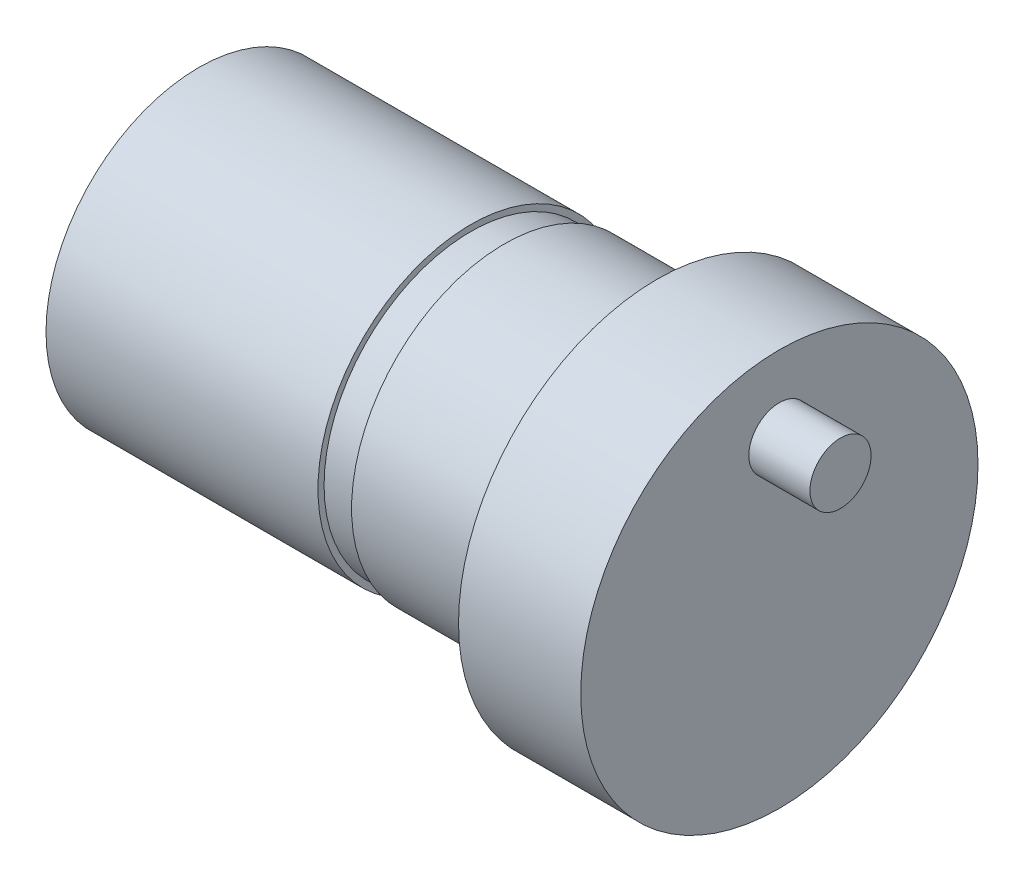
ISO-10303-21;
HEADER;
FILE_DESCRIPTION(('STEP AP214'),'2;1');
FILE_NAME('part.step','',(''),(''),'','','');
FILE_SCHEMA(('AUTOMOTIVE_DESIGN { 1 0 10303 214 1 1 1 1 }'));
ENDSEC;
DATA;
#1=APPLICATION_CONTEXT('core data for automotive mechanical design processes');
#2=APPLICATION_PROTOCOL_DEFINITION('international standard','automotive_design',2000,#1);
#3=PRODUCT_CONTEXT('',#1,'mechanical');
#4=PRODUCT('Part','Part','',(#3));
#5=PRODUCT_RELATED_PRODUCT_CATEGORY('part','',(#4));
#6=PRODUCT_DEFINITION_FORMATION('','',#4);
#7=PRODUCT_DEFINITION_CONTEXT('part definition',#1,'design');
#8=PRODUCT_DEFINITION('design','',#6,#7);
#9=PRODUCT_DEFINITION_SHAPE('','',#8);
#10=(LENGTH_UNIT() NAMED_UNIT(*) SI_UNIT(.MILLI.,.METRE.));
#11=(NAMED_UNIT(*) PLANE_ANGLE_UNIT() SI_UNIT($,.RADIAN.));
#12=(NAMED_UNIT(*) SI_UNIT($,.STERADIAN.) SOLID_ANGLE_UNIT());
#13=UNCERTAINTY_MEASURE_WITH_UNIT(LENGTH_MEASURE(1.E-05),#10,'distance_accuracy_value','');
#14=(GEOMETRIC_REPRESENTATION_CONTEXT(3) GLOBAL_UNCERTAINTY_ASSIGNED_CONTEXT((#13)) GLOBAL_UNIT_ASSIGNED_CONTEXT((#10,
#11,#12)) REPRESENTATION_CONTEXT('',''));
#15=CARTESIAN_POINT('',(0.,0.,0.));
#16=DIRECTION('',(0.,0.,1.));
#17=DIRECTION('',(1.,0.,0.));
#18=AXIS2_PLACEMENT_3D('',#15,#16,#17);
#19=CARTESIAN_POINT('',(-15.,0.,0.));
#20=DIRECTION('',(1.,0.,0.));
#21=DIRECTION('',(0.,0.,-1.));
#22=AXIS2_PLACEMENT_3D('',#19,#20,#21);
#23=CYLINDRICAL_SURFACE('',#22,5.);
#24=CARTESIAN_POINT('',(0.,0.,0.));
#25=DIRECTION('',(-1.,0.,0.));
#26=DIRECTION('',(0.,0.,1.));
#27=AXIS2_PLACEMENT_3D('',#24,#25,#26);
#28=CIRCLE('',#27,5.);
#29=CARTESIAN_POINT('',(0.,0.,5.));
#30=VERTEX_POINT('',#29);
#31=EDGE_CURVE('E10',#30,#30,#28,.T.);
#32=ORIENTED_EDGE('',*,*,#31,.T.);
#33=EDGE_LOOP('',(#32));
#34=FACE_BOUND('',#33,.T.);
#35=CARTESIAN_POINT('',(-5.,0.,0.));
#36=DIRECTION('',(1.,0.,0.));
#37=DIRECTION('',(0.,0.,-1.));
#38=AXIS2_PLACEMENT_3D('',#35,#36,#37);
#39=CIRCLE('',#38,5.);
#40=CARTESIAN_POINT('',(-5.,0.,-5.));
#41=VERTEX_POINT('',#40);
#42=EDGE_CURVE('E74',#41,#41,#39,.T.);
#43=ORIENTED_EDGE('',*,*,#42,.T.);
#44=EDGE_LOOP('',(#43));
#45=FACE_BOUND('',#44,.T.);
#46=ADVANCED_FACE('F42',(#34,#45),#23,.T.);
#47=CARTESIAN_POINT('',(4.,0.,0.));
#48=DIRECTION('',(-1.,0.,0.));
#49=DIRECTION('',(0.,0.,1.));
#50=AXIS2_PLACEMENT_3D('',#47,#48,#49);
#51=CYLINDRICAL_SURFACE('',#50,6.5);
#52=CARTESIAN_POINT('',(4.,0.,0.));
#53=DIRECTION('',(1.,0.,0.));
#54=DIRECTION('',(0.,0.,-1.));
#55=AXIS2_PLACEMENT_3D('',#52,#53,#54);
#56=CIRCLE('',#55,6.5);
#57=CARTESIAN_POINT('',(4.,0.,-6.5));
#58=VERTEX_POINT('',#57);
#59=EDGE_CURVE('E50',#58,#58,#56,.T.);
#60=ORIENTED_EDGE('',*,*,#59,.F.);
#61=EDGE_LOOP('',(#60));
#62=FACE_BOUND('',#61,.T.);
#63=CARTESIAN_POINT('',(0.,0.,0.));
#64=DIRECTION('',(1.,0.,0.));
#65=DIRECTION('',(0.,0.,-1.));
#66=AXIS2_PLACEMENT_3D('',#63,#64,#65);
#67=CIRCLE('',#66,6.5);
#68=CARTESIAN_POINT('',(0.,0.,-6.5));
#69=VERTEX_POINT('',#68);
#70=EDGE_CURVE('E46',#69,#69,#67,.T.);
#71=ORIENTED_EDGE('',*,*,#70,.T.);
#72=EDGE_LOOP('',(#71));
#73=FACE_BOUND('',#72,.T.);
#74=ADVANCED_FACE('F44',(#62,#73),#51,.T.);
#75=CARTESIAN_POINT('',(4.,0.,0.));
#76=DIRECTION('',(1.,0.,0.));
#77=DIRECTION('',(0.,0.,-1.));
#78=AXIS2_PLACEMENT_3D('',#75,#76,#77);
#79=PLANE('',#78);
#80=CARTESIAN_POINT('',(4.,4.,0.));
#81=DIRECTION('',(1.,0.,0.));
#82=DIRECTION('',(0.,0.,-1.));
#83=AXIS2_PLACEMENT_3D('',#80,#81,#82);
#84=CIRCLE('',#83,1.);
#85=CARTESIAN_POINT('',(4.,4.,-1.));
#86=VERTEX_POINT('',#85);
#87=EDGE_CURVE('E60',#86,#86,#84,.T.);
#88=ORIENTED_EDGE('',*,*,#87,.F.);
#89=EDGE_LOOP('',(#88));
#90=FACE_BOUND('',#89,.T.);
#91=ORIENTED_EDGE('',*,*,#59,.T.);
#92=EDGE_LOOP('',(#91));
#93=FACE_BOUND('',#92,.T.);
#94=ADVANCED_FACE('F101',(#90,#93),#79,.T.);
#95=CARTESIAN_POINT('',(0.,0.,0.));
#96=DIRECTION('',(1.,0.,0.));
#97=DIRECTION('',(0.,0.,-1.));
#98=AXIS2_PLACEMENT_3D('',#95,#96,#97);
#99=PLANE('',#98);
#100=ORIENTED_EDGE('',*,*,#31,.F.);
#101=EDGE_LOOP('',(#100));
#102=FACE_BOUND('',#101,.T.);
#103=ORIENTED_EDGE('',*,*,#70,.F.);
#104=EDGE_LOOP('',(#103));
#105=FACE_BOUND('',#104,.T.);
#106=ADVANCED_FACE('F157',(#102,#105),#99,.F.);
#107=CARTESIAN_POINT('',(6.,4.,0.));
#108=DIRECTION('',(-1.,0.,0.));
#109=DIRECTION('',(0.,0.,1.));
#110=AXIS2_PLACEMENT_3D('',#107,#108,#109);
#111=CYLINDRICAL_SURFACE('',#110,1.);
#112=CARTESIAN_POINT('',(6.,4.,0.));
#113=DIRECTION('',(1.,0.,0.));
#114=DIRECTION('',(0.,0.,-1.));
#115=AXIS2_PLACEMENT_3D('',#112,#113,#114);
#116=CIRCLE('',#115,1.);
#117=CARTESIAN_POINT('',(6.,4.,-1.));
#118=VERTEX_POINT('',#117);
#119=EDGE_CURVE('E59',#118,#118,#116,.T.);
#120=ORIENTED_EDGE('',*,*,#119,.F.);
#121=EDGE_LOOP('',(#120));
#122=FACE_BOUND('',#121,.T.);
#123=ORIENTED_EDGE('',*,*,#87,.T.);
#124=EDGE_LOOP('',(#123));
#125=FACE_BOUND('',#124,.T.);
#126=ADVANCED_FACE('F93',(#122,#125),#111,.T.);
#127=CARTESIAN_POINT('',(6.,4.,0.));
#128=DIRECTION('',(1.,0.,0.));
#129=DIRECTION('',(0.,0.,-1.));
#130=AXIS2_PLACEMENT_3D('',#127,#128,#129);
#131=PLANE('',#130);
#132=ORIENTED_EDGE('',*,*,#119,.T.);
#133=EDGE_LOOP('',(#132));
#134=FACE_BOUND('',#133,.T.);
#135=ADVANCED_FACE('F82',(#134),#131,.T.);
#136=CARTESIAN_POINT('',(-5.,5.,0.));
#137=DIRECTION('',(-1.,0.,0.));
#138=DIRECTION('',(0.,0.,1.));
#139=AXIS2_PLACEMENT_3D('',#136,#137,#138);
#140=PLANE('',#139);
#141=CARTESIAN_POINT('',(-5.,0.,0.));
#142=DIRECTION('',(1.,0.,0.));
#143=DIRECTION('',(0.,0.,-1.));
#144=AXIS2_PLACEMENT_3D('',#141,#142,#143);
#145=CIRCLE('',#144,4.8);
#146=CARTESIAN_POINT('',(-5.,0.,-4.8));
#147=VERTEX_POINT('',#146);
#148=EDGE_CURVE('E63',#147,#147,#145,.T.);
#149=ORIENTED_EDGE('',*,*,#148,.T.);
#150=EDGE_LOOP('',(#149));
#151=FACE_BOUND('',#150,.T.);
#152=ORIENTED_EDGE('',*,*,#42,.F.);
#153=EDGE_LOOP('',(#152));
#154=FACE_BOUND('',#153,.T.);
#155=ADVANCED_FACE('F79',(#151,#154),#140,.T.);
#156=CARTESIAN_POINT('',(-1.17847048189077,0.,0.));
#157=DIRECTION('',(1.,0.,0.));
#158=DIRECTION('',(0.,0.,-1.));
#159=AXIS2_PLACEMENT_3D('',#156,#157,#158);
#160=CYLINDRICAL_SURFACE('',#159,4.8);
#161=CARTESIAN_POINT('',(-6.1,0.,0.));
#162=DIRECTION('',(1.,0.,0.));
#163=DIRECTION('',(0.,0.,-1.));
#164=AXIS2_PLACEMENT_3D('',#161,#162,#163);
#165=CIRCLE('',#164,4.8);
#166=CARTESIAN_POINT('',(-6.1,0.,-4.8));
#167=VERTEX_POINT('',#166);
#168=EDGE_CURVE('E68',#167,#167,#165,.T.);
#169=ORIENTED_EDGE('',*,*,#168,.T.);
#170=EDGE_LOOP('',(#169));
#171=FACE_BOUND('',#170,.T.);
#172=ORIENTED_EDGE('',*,*,#148,.F.);
#173=EDGE_LOOP('',(#172));
#174=FACE_BOUND('',#173,.T.);
#175=ADVANCED_FACE('F81',(#171,#174),#160,.T.);
#176=CARTESIAN_POINT('',(-6.1,4.8,0.));
#177=DIRECTION('',(1.,0.,0.));
#178=DIRECTION('',(0.,0.,-1.));
#179=AXIS2_PLACEMENT_3D('',#176,#177,#178);
#180=PLANE('',#179);
#181=CARTESIAN_POINT('',(-6.1,0.,0.));
#182=DIRECTION('',(1.,0.,0.));
#183=DIRECTION('',(0.,0.,-1.));
#184=AXIS2_PLACEMENT_3D('',#181,#182,#183);
#185=CIRCLE('',#184,5.);
#186=CARTESIAN_POINT('',(-6.1,0.,-5.));
#187=VERTEX_POINT('',#186);
#188=EDGE_CURVE('E71',#187,#187,#185,.T.);
#189=ORIENTED_EDGE('',*,*,#188,.T.);
#190=EDGE_LOOP('',(#189));
#191=FACE_BOUND('',#190,.T.);
#192=ORIENTED_EDGE('',*,*,#168,.F.);
#193=EDGE_LOOP('',(#192));
#194=FACE_BOUND('',#193,.T.);
#195=ADVANCED_FACE('F89',(#191,#194),#180,.T.);
#196=CARTESIAN_POINT('',(-15.,0.,0.));
#197=DIRECTION('',(-1.,0.,0.));
#198=DIRECTION('',(0.,0.,1.));
#199=AXIS2_PLACEMENT_3D('',#196,#197,#198);
#200=PLANE('',#199);
#201=CARTESIAN_POINT('',(-15.,0.,0.));
#202=DIRECTION('',(-1.,0.,0.));
#203=DIRECTION('',(0.,0.,1.));
#204=AXIS2_PLACEMENT_3D('',#201,#202,#203);
#205=CIRCLE('',#204,5.);
#206=CARTESIAN_POINT('',(-15.,0.,5.));
#207=VERTEX_POINT('',#206);
#208=EDGE_CURVE('E56',#207,#207,#205,.T.);
#209=ORIENTED_EDGE('',*,*,#208,.T.);
#210=EDGE_LOOP('',(#209));
#211=FACE_BOUND('',#210,.T.);
#212=ADVANCED_FACE('F106',(#211),#200,.T.);
#213=ORIENTED_EDGE('',*,*,#208,.F.);
#214=EDGE_LOOP('',(#213));
#215=FACE_BOUND('',#214,.T.);
#216=ORIENTED_EDGE('',*,*,#188,.F.);
#217=EDGE_LOOP('',(#216));
#218=FACE_BOUND('',#217,.T.);
#219=ADVANCED_FACE('F97',(#215,#218),#23,.T.);
#220=CLOSED_SHELL('',(#46,#74,#94,#106,#126,#135,#155,#175,#195,#212,#219));
#221=MANIFOLD_SOLID_BREP('B2',#220);
#222=ADVANCED_BREP_SHAPE_REPRESENTATION('',(#18,#221),#14);
#223=SHAPE_DEFINITION_REPRESENTATION(#9,#222);
ENDSEC;
END-ISO-10303-21;
